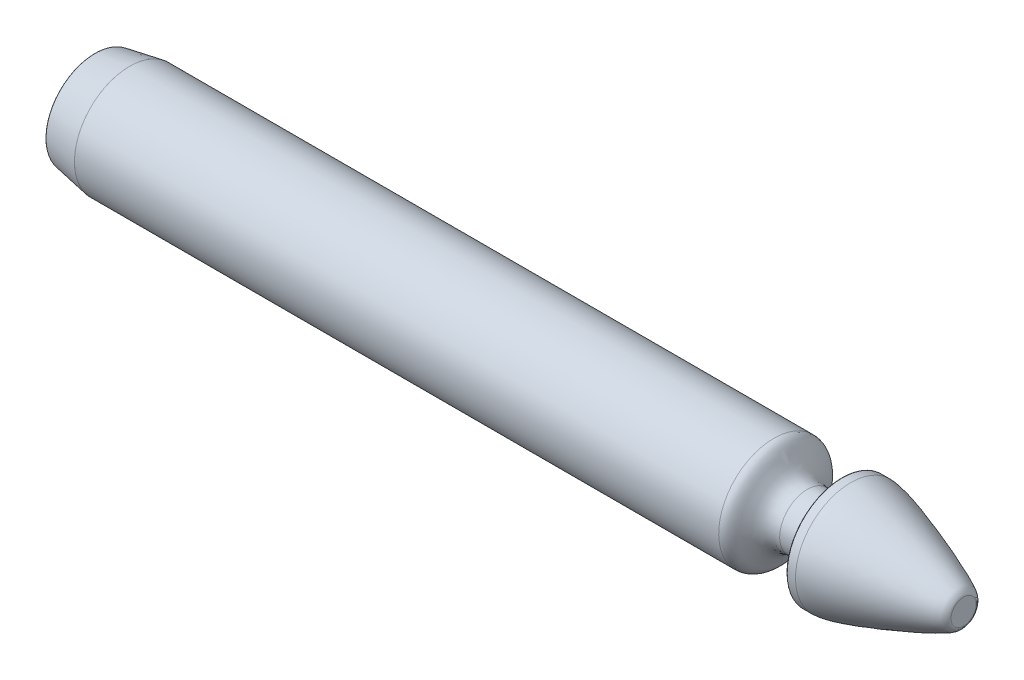
ISO-10303-21;
HEADER;
FILE_DESCRIPTION(('STEP AP214'),'2;1');
FILE_NAME('part.step','',(''),(''),'','','');
FILE_SCHEMA(('AUTOMOTIVE_DESIGN { 1 0 10303 214 1 1 1 1 }'));
ENDSEC;
DATA;
#1=APPLICATION_CONTEXT('core data for automotive mechanical design processes');
#2=APPLICATION_PROTOCOL_DEFINITION('international standard','automotive_design',2000,#1);
#3=PRODUCT_CONTEXT('',#1,'mechanical');
#4=PRODUCT('Part','Part','',(#3));
#5=PRODUCT_RELATED_PRODUCT_CATEGORY('part','',(#4));
#6=PRODUCT_DEFINITION_FORMATION('','',#4);
#7=PRODUCT_DEFINITION_CONTEXT('part definition',#1,'design');
#8=PRODUCT_DEFINITION('design','',#6,#7);
#9=PRODUCT_DEFINITION_SHAPE('','',#8);
#10=(LENGTH_UNIT() NAMED_UNIT(*) SI_UNIT(.MILLI.,.METRE.));
#11=(NAMED_UNIT(*) PLANE_ANGLE_UNIT() SI_UNIT($,.RADIAN.));
#12=(NAMED_UNIT(*) SI_UNIT($,.STERADIAN.) SOLID_ANGLE_UNIT());
#13=UNCERTAINTY_MEASURE_WITH_UNIT(LENGTH_MEASURE(1.E-05),#10,'distance_accuracy_value','');
#14=(GEOMETRIC_REPRESENTATION_CONTEXT(3) GLOBAL_UNCERTAINTY_ASSIGNED_CONTEXT((#13)) GLOBAL_UNIT_ASSIGNED_CONTEXT((#10,
#11,#12)) REPRESENTATION_CONTEXT('',''));
#15=CARTESIAN_POINT('',(0.,0.,0.));
#16=DIRECTION('',(0.,0.,1.));
#17=DIRECTION('',(1.,0.,0.));
#18=AXIS2_PLACEMENT_3D('',#15,#16,#17);
#19=CARTESIAN_POINT('',(0.,0.72457972503932,0.));
#20=DIRECTION('',(1.,0.,0.));
#21=DIRECTION('',(0.,1.,0.));
#22=AXIS2_PLACEMENT_3D('',#19,#20,#21);
#23=PLANE('',#22);
#24=CARTESIAN_POINT('',(0.,0.,0.));
#25=DIRECTION('',(1.,0.,0.));
#26=DIRECTION('',(0.,1.,0.));
#27=AXIS2_PLACEMENT_3D('',#24,#25,#26);
#28=CIRCLE('',#27,0.72457972503932);
#29=CARTESIAN_POINT('',(0.,0.72457972503932,0.));
#30=VERTEX_POINT('',#29);
#31=EDGE_CURVE('E58',#30,#30,#28,.T.);
#32=ORIENTED_EDGE('',*,*,#31,.T.);
#33=EDGE_LOOP('',(#32));
#34=FACE_BOUND('',#33,.T.);
#35=ADVANCED_FACE('F32',(#34),#23,.T.);
#36=CARTESIAN_POINT('',(0.,0.72457972503932,0.));
#37=CARTESIAN_POINT('',(0.,0.774017780718538,0.));
#38=CARTESIAN_POINT('',(-0.00965429658686024,0.817143972358175,0.));
#39=CARTESIAN_POINT('',(-0.421041723898246,1.30227425913091,0.));
#40=CARTESIAN_POINT('',(-5.48408437815375,3.175,0.));
#41=CARTESIAN_POINT('',(-6.5,3.175,0.));
#42=B_SPLINE_CURVE_WITH_KNOTS('',3,(#36,#37,#38,#39,#40,#41),.UNSPECIFIED.,.F.,.F.,(4,1,1,4),
(0.,0.313862368643612,0.413862368643612,1.),.UNSPECIFIED.);
#43=CARTESIAN_POINT('',(0.,0.,0.));
#44=DIRECTION('',(1.,0.,0.));
#45=AXIS1_PLACEMENT('',#43,#44);
#46=SURFACE_OF_REVOLUTION('',#42,#45);
#47=CARTESIAN_POINT('',(-6.5,0.,0.));
#48=DIRECTION('',(1.,0.,0.));
#49=DIRECTION('',(0.,1.,0.));
#50=AXIS2_PLACEMENT_3D('',#47,#48,#49);
#51=CIRCLE('',#50,3.175);
#52=CARTESIAN_POINT('',(-6.5,3.175,0.));
#53=VERTEX_POINT('',#52);
#54=EDGE_CURVE('E61',#53,#53,#51,.T.);
#55=ORIENTED_EDGE('',*,*,#54,.T.);
#56=EDGE_LOOP('',(#55));
#57=FACE_BOUND('',#56,.T.);
#58=ORIENTED_EDGE('',*,*,#31,.F.);
#59=EDGE_LOOP('',(#58));
#60=FACE_BOUND('',#59,.T.);
#61=ADVANCED_FACE('F101',(#57,#60),#46,.F.);
#62=CARTESIAN_POINT('',(0.,0.,0.));
#63=DIRECTION('',(1.,0.,0.));
#64=DIRECTION('',(0.,1.,0.));
#65=AXIS2_PLACEMENT_3D('',#62,#63,#64);
#66=CYLINDRICAL_SURFACE('',#65,3.175);
#67=CARTESIAN_POINT('',(-6.98,0.,0.));
#68=DIRECTION('',(-1.,0.,0.));
#69=DIRECTION('',(0.,-1.,0.));
#70=AXIS2_PLACEMENT_3D('',#67,#68,#69);
#71=CIRCLE('',#70,3.175);
#72=CARTESIAN_POINT('',(-6.98,-3.175,0.));
#73=VERTEX_POINT('',#72);
#74=EDGE_CURVE('E39',#73,#73,#71,.F.);
#75=ORIENTED_EDGE('',*,*,#74,.T.);
#76=EDGE_LOOP('',(#75));
#77=FACE_BOUND('',#76,.T.);
#78=ORIENTED_EDGE('',*,*,#54,.F.);
#79=EDGE_LOOP('',(#78));
#80=FACE_BOUND('',#79,.T.);
#81=ADVANCED_FACE('F98',(#77,#80),#66,.T.);
#82=CARTESIAN_POINT('',(-7.,3.175,0.));
#83=DIRECTION('',(-1.,0.,0.));
#84=DIRECTION('',(0.,-1.,0.));
#85=AXIS2_PLACEMENT_3D('',#82,#83,#84);
#86=PLANE('',#85);
#87=CARTESIAN_POINT('',(-7.,0.,0.));
#88=DIRECTION('',(-1.,0.,0.));
#89=DIRECTION('',(0.,-1.,0.));
#90=AXIS2_PLACEMENT_3D('',#87,#88,#89);
#91=CIRCLE('',#90,3.155);
#92=CARTESIAN_POINT('',(-7.,-3.155,0.));
#93=VERTEX_POINT('',#92);
#94=EDGE_CURVE('E10',#93,#93,#91,.T.);
#95=ORIENTED_EDGE('',*,*,#94,.T.);
#96=EDGE_LOOP('',(#95));
#97=FACE_BOUND('',#96,.T.);
#98=CARTESIAN_POINT('',(-7.,0.,0.));
#99=DIRECTION('',(1.,0.,0.));
#100=DIRECTION('',(0.,1.,0.));
#101=AXIS2_PLACEMENT_3D('',#98,#99,#100);
#102=CIRCLE('',#101,1.5875);
#103=CARTESIAN_POINT('',(-7.,1.5875,0.));
#104=VERTEX_POINT('',#103);
#105=EDGE_CURVE('E64',#104,#104,#102,.T.);
#106=ORIENTED_EDGE('',*,*,#105,.T.);
#107=EDGE_LOOP('',(#106));
#108=FACE_BOUND('',#107,.T.);
#109=ADVANCED_FACE('F94',(#97,#108),#86,.T.);
#110=CARTESIAN_POINT('',(0.,0.,0.));
#111=DIRECTION('',(1.,0.,0.));
#112=DIRECTION('',(0.,1.,0.));
#113=AXIS2_PLACEMENT_3D('',#110,#111,#112);
#114=CYLINDRICAL_SURFACE('',#113,1.5875);
#115=CARTESIAN_POINT('',(-9.,0.,0.));
#116=DIRECTION('',(1.,0.,0.));
#117=DIRECTION('',(0.,1.,0.));
#118=AXIS2_PLACEMENT_3D('',#115,#116,#117);
#119=CIRCLE('',#118,1.5875);
#120=CARTESIAN_POINT('',(-9.,1.5875,0.));
#121=VERTEX_POINT('',#120);
#122=EDGE_CURVE('E67',#121,#121,#119,.T.);
#123=ORIENTED_EDGE('',*,*,#122,.T.);
#124=EDGE_LOOP('',(#123));
#125=FACE_BOUND('',#124,.T.);
#126=ORIENTED_EDGE('',*,*,#105,.F.);
#127=EDGE_LOOP('',(#126));
#128=FACE_BOUND('',#127,.T.);
#129=ADVANCED_FACE('F89',(#125,#128),#114,.T.);
#130=CARTESIAN_POINT('',(-9.,1.5875,0.));
#131=CARTESIAN_POINT('',(-10.2500404854687,1.5875,0.));
#132=CARTESIAN_POINT('',(-10.1654474256533,3.175,0.));
#133=CARTESIAN_POINT('',(-10.9217886147105,3.175,0.));
#134=B_SPLINE_CURVE_WITH_KNOTS('',3,(#130,#131,#132,#133),.UNSPECIFIED.,.F.,.F.,(4,4),(0.,1.),.UNSPECIFIED.);
#135=CARTESIAN_POINT('',(0.,0.,0.));
#136=DIRECTION('',(1.,0.,0.));
#137=AXIS1_PLACEMENT('',#135,#136);
#138=SURFACE_OF_REVOLUTION('',#134,#137);
#139=CARTESIAN_POINT('',(-10.9217886147105,0.,0.));
#140=DIRECTION('',(1.,0.,0.));
#141=DIRECTION('',(0.,1.,0.));
#142=AXIS2_PLACEMENT_3D('',#139,#140,#141);
#143=CIRCLE('',#142,3.175);
#144=CARTESIAN_POINT('',(-10.9217886147105,3.175,0.));
#145=VERTEX_POINT('',#144);
#146=EDGE_CURVE('E70',#145,#145,#143,.T.);
#147=ORIENTED_EDGE('',*,*,#146,.T.);
#148=EDGE_LOOP('',(#147));
#149=FACE_BOUND('',#148,.T.);
#150=ORIENTED_EDGE('',*,*,#122,.F.);
#151=EDGE_LOOP('',(#150));
#152=FACE_BOUND('',#151,.T.);
#153=ADVANCED_FACE('F84',(#149,#152),#138,.F.);
#154=CARTESIAN_POINT('',(0.,0.,0.));
#155=DIRECTION('',(1.,0.,0.));
#156=DIRECTION('',(0.,1.,0.));
#157=AXIS2_PLACEMENT_3D('',#154,#155,#156);
#158=CYLINDRICAL_SURFACE('',#157,3.175);
#159=CARTESIAN_POINT('',(-47.9982502267295,0.,0.));
#160=DIRECTION('',(-1.,0.,0.));
#161=DIRECTION('',(0.,-1.,0.));
#162=AXIS2_PLACEMENT_3D('',#159,#160,#161);
#163=CIRCLE('',#162,3.175);
#164=CARTESIAN_POINT('',(-47.9982502267295,-3.175,0.));
#165=VERTEX_POINT('',#164);
#166=EDGE_CURVE('E43',#165,#165,#163,.F.);
#167=ORIENTED_EDGE('',*,*,#166,.T.);
#168=EDGE_LOOP('',(#167));
#169=FACE_BOUND('',#168,.T.);
#170=ORIENTED_EDGE('',*,*,#146,.F.);
#171=EDGE_LOOP('',(#170));
#172=FACE_BOUND('',#171,.T.);
#173=ADVANCED_FACE('F88',(#169,#172),#158,.T.);
#174=CARTESIAN_POINT('',(-48.,0.,0.));
#175=DIRECTION('',(1.,0.,0.));
#176=DIRECTION('',(0.,1.,0.));
#177=AXIS2_PLACEMENT_3D('',#174,#175,#176);
#178=CONICAL_SURFACE('',#177,3.175,0.174532925199434);
#179=CARTESIAN_POINT('',(-49.9834729635533,0.,0.));
#180=DIRECTION('',(-1.,0.,0.));
#181=DIRECTION('',(0.,-1.,0.));
#182=AXIS2_PLACEMENT_3D('',#179,#180,#181);
#183=CIRCLE('',#182,2.82526020101977);
#184=CARTESIAN_POINT('',(-49.9834729635533,-2.82526020101977,0.));
#185=VERTEX_POINT('',#184);
#186=EDGE_CURVE('E52',#185,#185,#183,.F.);
#187=ORIENTED_EDGE('',*,*,#186,.T.);
#188=EDGE_LOOP('',(#187));
#189=FACE_BOUND('',#188,.T.);
#190=CARTESIAN_POINT('',(-48.0017231902828,0.,0.));
#191=DIRECTION('',(-1.,0.,0.));
#192=DIRECTION('',(0.,-1.,0.));
#193=AXIS2_PLACEMENT_3D('',#190,#191,#192);
#194=CIRCLE('',#193,3.17469615506024);
#195=CARTESIAN_POINT('',(-48.0017231902828,-3.17469615506025,0.));
#196=VERTEX_POINT('',#195);
#197=EDGE_CURVE('E55',#196,#196,#194,.T.);
#198=ORIENTED_EDGE('',*,*,#197,.T.);
#199=EDGE_LOOP('',(#198));
#200=FACE_BOUND('',#199,.T.);
#201=ADVANCED_FACE('F125',(#189,#200),#178,.T.);
#202=CARTESIAN_POINT('',(-50.,0.,0.));
#203=DIRECTION('',(-1.,0.,0.));
#204=DIRECTION('',(0.,-1.,0.));
#205=AXIS2_PLACEMENT_3D('',#202,#203,#204);
#206=PLANE('',#205);
#207=CARTESIAN_POINT('',(-50.,0.,0.));
#208=DIRECTION('',(-1.,0.,0.));
#209=DIRECTION('',(0.,-1.,0.));
#210=AXIS2_PLACEMENT_3D('',#207,#208,#209);
#211=CIRCLE('',#210,2.80556404595952);
#212=CARTESIAN_POINT('',(-50.,-2.80556404595953,0.));
#213=VERTEX_POINT('',#212);
#214=EDGE_CURVE('E47',#213,#213,#211,.T.);
#215=ORIENTED_EDGE('',*,*,#214,.T.);
#216=EDGE_LOOP('',(#215));
#217=FACE_BOUND('',#216,.T.);
#218=ADVANCED_FACE('F111',(#217),#206,.T.);
#219=CARTESIAN_POINT('',(-49.98,0.,0.));
#220=DIRECTION('',(-1.,0.,0.));
#221=DIRECTION('',(0.,-1.,0.));
#222=AXIS2_PLACEMENT_3D('',#219,#220,#221);
#223=TOROIDAL_SURFACE('',#222,2.80556404595952,0.02);
#224=ORIENTED_EDGE('',*,*,#214,.F.);
#225=EDGE_LOOP('',(#224));
#226=FACE_BOUND('',#225,.T.);
#227=ORIENTED_EDGE('',*,*,#186,.F.);
#228=EDGE_LOOP('',(#227));
#229=FACE_BOUND('',#228,.T.);
#230=ADVANCED_FACE('F108',(#226,#229),#223,.T.);
#231=CARTESIAN_POINT('',(-47.9982502267295,0.,0.));
#232=DIRECTION('',(-1.,0.,0.));
#233=DIRECTION('',(0.,-1.,0.));
#234=AXIS2_PLACEMENT_3D('',#231,#232,#233);
#235=TOROIDAL_SURFACE('',#234,3.155,0.02);
#236=ORIENTED_EDGE('',*,*,#197,.F.);
#237=EDGE_LOOP('',(#236));
#238=FACE_BOUND('',#237,.T.);
#239=ORIENTED_EDGE('',*,*,#166,.F.);
#240=EDGE_LOOP('',(#239));
#241=FACE_BOUND('',#240,.T.);
#242=ADVANCED_FACE('F110',(#238,#241),#235,.T.);
#243=CARTESIAN_POINT('',(-6.98,0.,0.));
#244=DIRECTION('',(-1.,0.,0.));
#245=DIRECTION('',(0.,-1.,0.));
#246=AXIS2_PLACEMENT_3D('',#243,#244,#245);
#247=TOROIDAL_SURFACE('',#246,3.155,0.02);
#248=ORIENTED_EDGE('',*,*,#94,.F.);
#249=EDGE_LOOP('',(#248));
#250=FACE_BOUND('',#249,.T.);
#251=ORIENTED_EDGE('',*,*,#74,.F.);
#252=EDGE_LOOP('',(#251));
#253=FACE_BOUND('',#252,.T.);
#254=ADVANCED_FACE('F34',(#250,#253),#247,.T.);
#255=CLOSED_SHELL('',(#35,#61,#81,#109,#129,#153,#173,#201,#218,#230,#242,#254));
#256=MANIFOLD_SOLID_BREP('B2',#255);
#257=ADVANCED_BREP_SHAPE_REPRESENTATION('',(#18,#256),#14);
#258=SHAPE_DEFINITION_REPRESENTATION(#9,#257);
ENDSEC;
END-ISO-10303-21;
